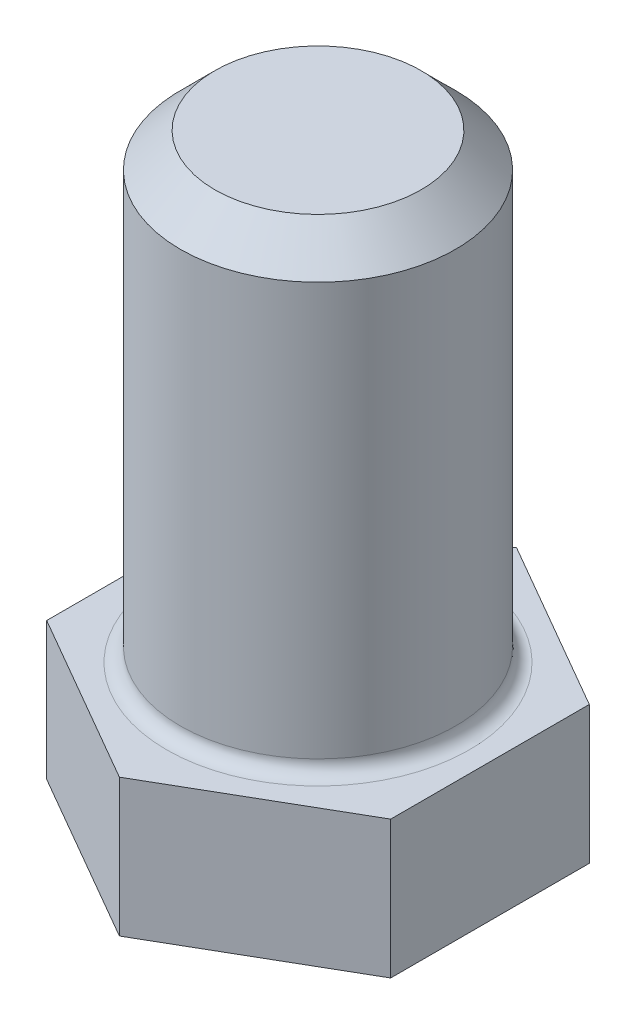
ISO-10303-21;
HEADER;
FILE_DESCRIPTION(('STEP AP214'),'2;1');
FILE_NAME('part.step','',(''),(''),'','','');
FILE_SCHEMA(('AUTOMOTIVE_DESIGN { 1 0 10303 214 1 1 1 1 }'));
ENDSEC;
DATA;
#1=APPLICATION_CONTEXT('core data for automotive mechanical design processes');
#2=APPLICATION_PROTOCOL_DEFINITION('international standard','automotive_design',2000,#1);
#3=PRODUCT_CONTEXT('',#1,'mechanical');
#4=PRODUCT('Part','Part','',(#3));
#5=PRODUCT_RELATED_PRODUCT_CATEGORY('part','',(#4));
#6=PRODUCT_DEFINITION_FORMATION('','',#4);
#7=PRODUCT_DEFINITION_CONTEXT('part definition',#1,'design');
#8=PRODUCT_DEFINITION('design','',#6,#7);
#9=PRODUCT_DEFINITION_SHAPE('','',#8);
#10=(LENGTH_UNIT() NAMED_UNIT(*) SI_UNIT(.MILLI.,.METRE.));
#11=(NAMED_UNIT(*) PLANE_ANGLE_UNIT() SI_UNIT($,.RADIAN.));
#12=(NAMED_UNIT(*) SI_UNIT($,.STERADIAN.) SOLID_ANGLE_UNIT());
#13=UNCERTAINTY_MEASURE_WITH_UNIT(LENGTH_MEASURE(1.E-05),#10,'distance_accuracy_value','');
#14=(GEOMETRIC_REPRESENTATION_CONTEXT(3) GLOBAL_UNCERTAINTY_ASSIGNED_CONTEXT((#13)) GLOBAL_UNIT_ASSIGNED_CONTEXT((#10,
#11,#12)) REPRESENTATION_CONTEXT('',''));
#15=CARTESIAN_POINT('',(0.,0.,0.));
#16=DIRECTION('',(0.,0.,1.));
#17=DIRECTION('',(1.,0.,0.));
#18=AXIS2_PLACEMENT_3D('',#15,#16,#17);
#19=CARTESIAN_POINT('',(2.49999999999998,2.,-1.44337567297409));
#20=DIRECTION('',(-0.499999999999995,0.,0.866025403784442));
#21=DIRECTION('',(0.866025403784442,0.,0.499999999999995));
#22=AXIS2_PLACEMENT_3D('',#19,#20,#21);
#23=PLANE('',#22);
#24=DIRECTION('',(-0.866025403784441,0.,-0.499999999999995));
#25=VECTOR('',#24,1.);
#26=CARTESIAN_POINT('',(2.49999999999998,0.,-1.44337567297409));
#27=LINE('',#26,#25);
#28=CARTESIAN_POINT('',(2.49999999999998,0.,-1.44337567297409));
#29=VERTEX_POINT('',#28);
#30=CARTESIAN_POINT('',(0.,0.,-2.88675134594813));
#31=VERTEX_POINT('',#30);
#32=EDGE_CURVE('E121',#29,#31,#27,.T.);
#33=ORIENTED_EDGE('',*,*,#32,.T.);
#34=DIRECTION('',(0.,-1.,0.));
#35=VECTOR('',#34,1.);
#36=CARTESIAN_POINT('',(0.,2.,-2.88675134594813));
#37=LINE('',#36,#35);
#38=CARTESIAN_POINT('',(0.,2.,-2.88675134594813));
#39=VERTEX_POINT('',#38);
#40=EDGE_CURVE('E138',#39,#31,#37,.T.);
#41=ORIENTED_EDGE('',*,*,#40,.F.);
#42=DIRECTION('',(-0.866025403784441,0.,-0.499999999999995));
#43=VECTOR('',#42,1.);
#44=CARTESIAN_POINT('',(2.49999999999998,2.,-1.44337567297409));
#45=LINE('',#44,#43);
#46=CARTESIAN_POINT('',(2.49999999999998,2.,-1.44337567297409));
#47=VERTEX_POINT('',#46);
#48=EDGE_CURVE('E131',#47,#39,#45,.T.);
#49=ORIENTED_EDGE('',*,*,#48,.F.);
#50=DIRECTION('',(0.,-1.,0.));
#51=VECTOR('',#50,1.);
#52=CARTESIAN_POINT('',(2.49999999999998,2.,-1.44337567297409));
#53=LINE('',#52,#51);
#54=EDGE_CURVE('E117',#47,#29,#53,.T.);
#55=ORIENTED_EDGE('',*,*,#54,.T.);
#56=EDGE_LOOP('',(#33,#41,#49,#55));
#57=FACE_BOUND('',#56,.T.);
#58=ADVANCED_FACE('F35',(#57),#23,.F.);
#59=CARTESIAN_POINT('',(0.,2.,-2.88675134594813));
#60=DIRECTION('',(0.500000000000001,0.,0.866025403784438));
#61=DIRECTION('',(0.866025403784438,0.,-0.500000000000001));
#62=AXIS2_PLACEMENT_3D('',#59,#60,#61);
#63=PLANE('',#62);
#64=DIRECTION('',(-0.866025403784438,0.,0.500000000000001));
#65=VECTOR('',#64,1.);
#66=CARTESIAN_POINT('',(0.,0.,-2.88675134594813));
#67=LINE('',#66,#65);
#68=CARTESIAN_POINT('',(-2.5,0.,-1.44337567297406));
#69=VERTEX_POINT('',#68);
#70=EDGE_CURVE('E124',#31,#69,#67,.T.);
#71=ORIENTED_EDGE('',*,*,#70,.T.);
#72=DIRECTION('',(0.,-1.,0.));
#73=VECTOR('',#72,1.);
#74=CARTESIAN_POINT('',(-2.5,2.,-1.44337567297406));
#75=LINE('',#74,#73);
#76=CARTESIAN_POINT('',(-2.5,2.,-1.44337567297406));
#77=VERTEX_POINT('',#76);
#78=EDGE_CURVE('E135',#77,#69,#75,.T.);
#79=ORIENTED_EDGE('',*,*,#78,.F.);
#80=DIRECTION('',(-0.866025403784438,0.,0.500000000000001));
#81=VECTOR('',#80,1.);
#82=CARTESIAN_POINT('',(0.,2.,-2.88675134594813));
#83=LINE('',#82,#81);
#84=EDGE_CURVE('E90',#39,#77,#83,.T.);
#85=ORIENTED_EDGE('',*,*,#84,.F.);
#86=ORIENTED_EDGE('',*,*,#40,.T.);
#87=EDGE_LOOP('',(#71,#79,#85,#86));
#88=FACE_BOUND('',#87,.T.);
#89=ADVANCED_FACE('F161',(#88),#63,.F.);
#90=CARTESIAN_POINT('',(-2.5,2.,-1.44337567297406));
#91=DIRECTION('',(1.,0.,0.));
#92=DIRECTION('',(0.,0.,-1.));
#93=AXIS2_PLACEMENT_3D('',#90,#91,#92);
#94=PLANE('',#93);
#95=DIRECTION('',(0.,0.,1.));
#96=VECTOR('',#95,1.);
#97=CARTESIAN_POINT('',(-2.5,0.,-1.44337567297406));
#98=LINE('',#97,#96);
#99=CARTESIAN_POINT('',(-2.49999999999999,0.,1.44337567297407));
#100=VERTEX_POINT('',#99);
#101=EDGE_CURVE('E126',#69,#100,#98,.T.);
#102=ORIENTED_EDGE('',*,*,#101,.T.);
#103=DIRECTION('',(0.,-1.,0.));
#104=VECTOR('',#103,1.);
#105=CARTESIAN_POINT('',(-2.49999999999999,2.,1.44337567297407));
#106=LINE('',#105,#104);
#107=CARTESIAN_POINT('',(-2.49999999999999,2.,1.44337567297407));
#108=VERTEX_POINT('',#107);
#109=EDGE_CURVE('E112',#108,#100,#106,.T.);
#110=ORIENTED_EDGE('',*,*,#109,.F.);
#111=DIRECTION('',(0.,0.,1.));
#112=VECTOR('',#111,1.);
#113=CARTESIAN_POINT('',(-2.5,2.,-1.44337567297406));
#114=LINE('',#113,#112);
#115=EDGE_CURVE('E103',#77,#108,#114,.T.);
#116=ORIENTED_EDGE('',*,*,#115,.F.);
#117=ORIENTED_EDGE('',*,*,#78,.T.);
#118=EDGE_LOOP('',(#102,#110,#116,#117));
#119=FACE_BOUND('',#118,.T.);
#120=ADVANCED_FACE('F167',(#119),#94,.F.);
#121=CARTESIAN_POINT('',(-2.49999999999999,2.,1.44337567297407));
#122=DIRECTION('',(0.499999999999995,0.,-0.866025403784442));
#123=DIRECTION('',(-0.866025403784442,0.,-0.499999999999995));
#124=AXIS2_PLACEMENT_3D('',#121,#122,#123);
#125=PLANE('',#124);
#126=DIRECTION('',(0.866025403784442,0.,0.499999999999995));
#127=VECTOR('',#126,1.);
#128=CARTESIAN_POINT('',(-2.49999999999999,0.,1.44337567297407));
#129=LINE('',#128,#127);
#130=CARTESIAN_POINT('',(0.,0.,2.88675134594812));
#131=VERTEX_POINT('',#130);
#132=EDGE_CURVE('E111',#100,#131,#129,.T.);
#133=ORIENTED_EDGE('',*,*,#132,.T.);
#134=DIRECTION('',(0.,-1.,0.));
#135=VECTOR('',#134,1.);
#136=CARTESIAN_POINT('',(0.,2.,2.88675134594812));
#137=LINE('',#136,#135);
#138=CARTESIAN_POINT('',(0.,2.,2.88675134594812));
#139=VERTEX_POINT('',#138);
#140=EDGE_CURVE('E108',#139,#131,#137,.T.);
#141=ORIENTED_EDGE('',*,*,#140,.F.);
#142=DIRECTION('',(0.866025403784442,0.,0.499999999999995));
#143=VECTOR('',#142,1.);
#144=CARTESIAN_POINT('',(-2.49999999999999,2.,1.44337567297407));
#145=LINE('',#144,#143);
#146=EDGE_CURVE('E97',#108,#139,#145,.T.);
#147=ORIENTED_EDGE('',*,*,#146,.F.);
#148=ORIENTED_EDGE('',*,*,#109,.T.);
#149=EDGE_LOOP('',(#133,#141,#147,#148));
#150=FACE_BOUND('',#149,.T.);
#151=ADVANCED_FACE('F109',(#150),#125,.F.);
#152=CARTESIAN_POINT('',(0.,2.,2.88675134594812));
#153=DIRECTION('',(-0.500000000000007,0.,-0.866025403784435));
#154=DIRECTION('',(-0.866025403784435,0.,0.500000000000007));
#155=AXIS2_PLACEMENT_3D('',#152,#153,#154);
#156=PLANE('',#155);
#157=DIRECTION('',(0.866025403784435,0.,-0.500000000000007));
#158=VECTOR('',#157,1.);
#159=CARTESIAN_POINT('',(0.,0.,2.88675134594812));
#160=LINE('',#159,#158);
#161=CARTESIAN_POINT('',(2.50000000000001,0.,1.44337567297404));
#162=VERTEX_POINT('',#161);
#163=EDGE_CURVE('E75',#131,#162,#160,.T.);
#164=ORIENTED_EDGE('',*,*,#163,.T.);
#165=DIRECTION('',(0.,-1.,0.));
#166=VECTOR('',#165,1.);
#167=CARTESIAN_POINT('',(2.50000000000001,2.,1.44337567297404));
#168=LINE('',#167,#166);
#169=CARTESIAN_POINT('',(2.50000000000001,2.,1.44337567297404));
#170=VERTEX_POINT('',#169);
#171=EDGE_CURVE('E113',#170,#162,#168,.T.);
#172=ORIENTED_EDGE('',*,*,#171,.F.);
#173=DIRECTION('',(0.866025403784435,0.,-0.500000000000007));
#174=VECTOR('',#173,1.);
#175=CARTESIAN_POINT('',(0.,2.,2.88675134594812));
#176=LINE('',#175,#174);
#177=EDGE_CURVE('E101',#139,#170,#176,.T.);
#178=ORIENTED_EDGE('',*,*,#177,.F.);
#179=ORIENTED_EDGE('',*,*,#140,.T.);
#180=EDGE_LOOP('',(#164,#172,#178,#179));
#181=FACE_BOUND('',#180,.T.);
#182=ADVANCED_FACE('F115',(#181),#156,.F.);
#183=CARTESIAN_POINT('',(2.50000000000001,2.,1.44337567297404));
#184=DIRECTION('',(-1.,0.,0.));
#185=DIRECTION('',(0.,0.,1.));
#186=AXIS2_PLACEMENT_3D('',#183,#184,#185);
#187=PLANE('',#186);
#188=DIRECTION('',(0.,0.,-1.));
#189=VECTOR('',#188,1.);
#190=CARTESIAN_POINT('',(2.50000000000001,0.,1.44337567297404));
#191=LINE('',#190,#189);
#192=EDGE_CURVE('E81',#162,#29,#191,.T.);
#193=ORIENTED_EDGE('',*,*,#192,.T.);
#194=ORIENTED_EDGE('',*,*,#54,.F.);
#195=DIRECTION('',(0.,0.,-1.));
#196=VECTOR('',#195,1.);
#197=CARTESIAN_POINT('',(2.50000000000001,2.,1.44337567297404));
#198=LINE('',#197,#196);
#199=EDGE_CURVE('E52',#170,#47,#198,.T.);
#200=ORIENTED_EDGE('',*,*,#199,.F.);
#201=ORIENTED_EDGE('',*,*,#171,.T.);
#202=EDGE_LOOP('',(#193,#194,#200,#201));
#203=FACE_BOUND('',#202,.T.);
#204=ADVANCED_FACE('F180',(#203),#187,.F.);
#205=CARTESIAN_POINT('',(0.,2.,0.));
#206=DIRECTION('',(0.,1.,0.));
#207=DIRECTION('',(0.,0.,1.));
#208=AXIS2_PLACEMENT_3D('',#205,#206,#207);
#209=PLANE('',#208);
#210=CARTESIAN_POINT('',(0.,2.,0.));
#211=DIRECTION('',(0.,1.,0.));
#212=DIRECTION('',(0.,0.,1.));
#213=AXIS2_PLACEMENT_3D('',#210,#211,#212);
#214=CIRCLE('',#213,2.2);
#215=CARTESIAN_POINT('',(0.,2.,2.2));
#216=VERTEX_POINT('',#215);
#217=EDGE_CURVE('E11',#216,#216,#214,.F.);
#218=ORIENTED_EDGE('',*,*,#217,.T.);
#219=EDGE_LOOP('',(#218));
#220=FACE_BOUND('',#219,.T.);
#221=ORIENTED_EDGE('',*,*,#48,.T.);
#222=ORIENTED_EDGE('',*,*,#84,.T.);
#223=ORIENTED_EDGE('',*,*,#115,.T.);
#224=ORIENTED_EDGE('',*,*,#146,.T.);
#225=ORIENTED_EDGE('',*,*,#177,.T.);
#226=ORIENTED_EDGE('',*,*,#199,.T.);
#227=EDGE_LOOP('',(#221,#222,#223,#224,#225,#226));
#228=FACE_BOUND('',#227,.T.);
#229=ADVANCED_FACE('F99',(#220,#228),#209,.T.);
#230=CARTESIAN_POINT('',(0.,0.,0.));
#231=DIRECTION('',(0.,1.,0.));
#232=DIRECTION('',(0.,0.,1.));
#233=AXIS2_PLACEMENT_3D('',#230,#231,#232);
#234=PLANE('',#233);
#235=ORIENTED_EDGE('',*,*,#32,.F.);
#236=ORIENTED_EDGE('',*,*,#192,.F.);
#237=ORIENTED_EDGE('',*,*,#163,.F.);
#238=ORIENTED_EDGE('',*,*,#132,.F.);
#239=ORIENTED_EDGE('',*,*,#101,.F.);
#240=ORIENTED_EDGE('',*,*,#70,.F.);
#241=EDGE_LOOP('',(#235,#236,#237,#238,#239,#240));
#242=FACE_BOUND('',#241,.T.);
#243=ADVANCED_FACE('F183',(#242),#234,.F.);
#244=CARTESIAN_POINT('',(0.,8.7,0.));
#245=DIRECTION('',(0.,-1.,0.));
#246=DIRECTION('',(0.,0.,-1.));
#247=AXIS2_PLACEMENT_3D('',#244,#245,#246);
#248=CYLINDRICAL_SURFACE('',#247,2.);
#249=CARTESIAN_POINT('',(0.,2.2,0.));
#250=DIRECTION('',(0.,1.,0.));
#251=DIRECTION('',(0.,0.,1.));
#252=AXIS2_PLACEMENT_3D('',#249,#250,#251);
#253=CIRCLE('',#252,2.);
#254=CARTESIAN_POINT('',(0.,2.2,2.));
#255=VERTEX_POINT('',#254);
#256=EDGE_CURVE('E44',#255,#255,#253,.T.);
#257=ORIENTED_EDGE('',*,*,#256,.T.);
#258=EDGE_LOOP('',(#257));
#259=FACE_BOUND('',#258,.T.);
#260=CARTESIAN_POINT('',(0.,8.2,0.));
#261=DIRECTION('',(0.,1.,0.));
#262=DIRECTION('',(0.,0.,1.));
#263=AXIS2_PLACEMENT_3D('',#260,#261,#262);
#264=CIRCLE('',#263,2.);
#265=CARTESIAN_POINT('',(0.,8.2,2.));
#266=VERTEX_POINT('',#265);
#267=EDGE_CURVE('E143',#266,#266,#264,.F.);
#268=ORIENTED_EDGE('',*,*,#267,.T.);
#269=EDGE_LOOP('',(#268));
#270=FACE_BOUND('',#269,.T.);
#271=ADVANCED_FACE('F148',(#259,#270),#248,.T.);
#272=CARTESIAN_POINT('',(0.,8.7,0.));
#273=DIRECTION('',(0.,1.,0.));
#274=DIRECTION('',(0.,0.,1.));
#275=AXIS2_PLACEMENT_3D('',#272,#273,#274);
#276=PLANE('',#275);
#277=CARTESIAN_POINT('',(0.,8.7,0.));
#278=DIRECTION('',(0.,1.,0.));
#279=DIRECTION('',(0.,0.,1.));
#280=AXIS2_PLACEMENT_3D('',#277,#278,#279);
#281=CIRCLE('',#280,1.5);
#282=CARTESIAN_POINT('',(0.,8.7,1.5));
#283=VERTEX_POINT('',#282);
#284=EDGE_CURVE('E140',#283,#283,#281,.T.);
#285=ORIENTED_EDGE('',*,*,#284,.T.);
#286=EDGE_LOOP('',(#285));
#287=FACE_BOUND('',#286,.T.);
#288=ADVANCED_FACE('F157',(#287),#276,.T.);
#289=CARTESIAN_POINT('',(0.,8.7,0.));
#290=DIRECTION('',(0.,-1.,0.));
#291=DIRECTION('',(0.,0.,-1.));
#292=AXIS2_PLACEMENT_3D('',#289,#290,#291);
#293=CONICAL_SURFACE('',#292,1.5,0.785398163397448);
#294=ORIENTED_EDGE('',*,*,#267,.F.);
#295=EDGE_LOOP('',(#294));
#296=FACE_BOUND('',#295,.T.);
#297=ORIENTED_EDGE('',*,*,#284,.F.);
#298=EDGE_LOOP('',(#297));
#299=FACE_BOUND('',#298,.T.);
#300=ADVANCED_FACE('F152',(#296,#299),#293,.T.);
#301=CARTESIAN_POINT('',(0.,2.2,0.));
#302=DIRECTION('',(0.,1.,0.));
#303=DIRECTION('',(0.,0.,1.));
#304=AXIS2_PLACEMENT_3D('',#301,#302,#303);
#305=TOROIDAL_SURFACE('',#304,2.2,0.2);
#306=ORIENTED_EDGE('',*,*,#217,.F.);
#307=EDGE_LOOP('',(#306));
#308=FACE_BOUND('',#307,.T.);
#309=ORIENTED_EDGE('',*,*,#256,.F.);
#310=EDGE_LOOP('',(#309));
#311=FACE_BOUND('',#310,.T.);
#312=ADVANCED_FACE('F37',(#308,#311),#305,.F.);
#313=CLOSED_SHELL('',(#58,#89,#120,#151,#182,#204,#229,#243,#271,#288,#300,#312));
#314=MANIFOLD_SOLID_BREP('B2',#313);
#315=ADVANCED_BREP_SHAPE_REPRESENTATION('',(#18,#314),#14);
#316=SHAPE_DEFINITION_REPRESENTATION(#9,#315);
ENDSEC;
END-ISO-10303-21;
